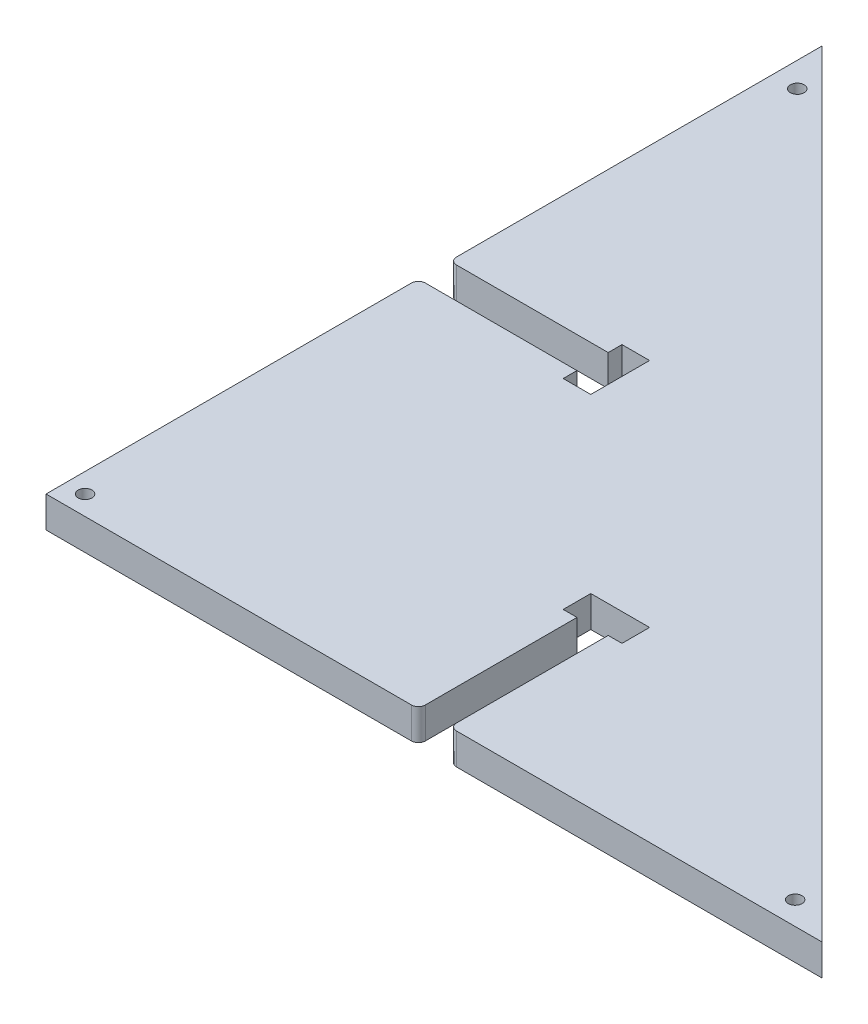
ISO-10303-21;
HEADER;
FILE_DESCRIPTION(('STEP AP214'),'2;1');
FILE_NAME('part.step','',(''),(''),'','','');
FILE_SCHEMA(('AUTOMOTIVE_DESIGN { 1 0 10303 214 1 1 1 1 }'));
ENDSEC;
DATA;
#1=APPLICATION_CONTEXT('core data for automotive mechanical design processes');
#2=APPLICATION_PROTOCOL_DEFINITION('international standard','automotive_design',2000,#1);
#3=PRODUCT_CONTEXT('',#1,'mechanical');
#4=PRODUCT('Part','Part','',(#3));
#5=PRODUCT_RELATED_PRODUCT_CATEGORY('part','',(#4));
#6=PRODUCT_DEFINITION_FORMATION('','',#4);
#7=PRODUCT_DEFINITION_CONTEXT('part definition',#1,'design');
#8=PRODUCT_DEFINITION('design','',#6,#7);
#9=PRODUCT_DEFINITION_SHAPE('','',#8);
#10=(LENGTH_UNIT() NAMED_UNIT(*) SI_UNIT(.MILLI.,.METRE.));
#11=(NAMED_UNIT(*) PLANE_ANGLE_UNIT() SI_UNIT($,.RADIAN.));
#12=(NAMED_UNIT(*) SI_UNIT($,.STERADIAN.) SOLID_ANGLE_UNIT());
#13=UNCERTAINTY_MEASURE_WITH_UNIT(LENGTH_MEASURE(1.E-05),#10,'distance_accuracy_value','');
#14=(GEOMETRIC_REPRESENTATION_CONTEXT(3) GLOBAL_UNCERTAINTY_ASSIGNED_CONTEXT((#13)) GLOBAL_UNIT_ASSIGNED_CONTEXT((#10,
#11,#12)) REPRESENTATION_CONTEXT('',''));
#15=CARTESIAN_POINT('',(0.,0.,0.));
#16=DIRECTION('',(0.,0.,1.));
#17=DIRECTION('',(1.,0.,0.));
#18=AXIS2_PLACEMENT_3D('',#15,#16,#17);
#19=CARTESIAN_POINT('',(176.552661596958,18.1,0.));
#20=DIRECTION('',(-1.,0.,0.));
#21=DIRECTION('',(0.,0.,1.));
#22=AXIS2_PLACEMENT_3D('',#19,#20,#21);
#23=PLANE('',#22);
#24=DIRECTION('',(0.,0.,-1.));
#25=VECTOR('',#24,1.);
#26=CARTESIAN_POINT('',(176.552661596958,0.,0.));
#27=LINE('',#26,#25);
#28=CARTESIAN_POINT('',(176.552661596958,0.,-58.5244296577947));
#29=VERTEX_POINT('',#28);
#30=CARTESIAN_POINT('',(176.552661596958,0.,-74.5244296577947));
#31=VERTEX_POINT('',#30);
#32=EDGE_CURVE('E258',#29,#31,#27,.T.);
#33=ORIENTED_EDGE('',*,*,#32,.T.);
#34=DIRECTION('',(0.,-1.,0.));
#35=VECTOR('',#34,1.);
#36=CARTESIAN_POINT('',(176.552661596958,18.1,-74.5244296577947));
#37=LINE('',#36,#35);
#38=CARTESIAN_POINT('',(176.552661596958,18.1,-74.5244296577947));
#39=VERTEX_POINT('',#38);
#40=EDGE_CURVE('E12',#39,#31,#37,.T.);
#41=ORIENTED_EDGE('',*,*,#40,.F.);
#42=DIRECTION('',(0.,0.,-1.));
#43=VECTOR('',#42,1.);
#44=CARTESIAN_POINT('',(176.552661596958,18.1,0.));
#45=LINE('',#44,#43);
#46=CARTESIAN_POINT('',(176.552661596958,18.1,-58.5244296577947));
#47=VERTEX_POINT('',#46);
#48=EDGE_CURVE('E329',#47,#39,#45,.T.);
#49=ORIENTED_EDGE('',*,*,#48,.F.);
#50=DIRECTION('',(0.,-1.,0.));
#51=VECTOR('',#50,1.);
#52=CARTESIAN_POINT('',(176.552661596958,18.1,-58.5244296577947));
#53=LINE('',#52,#51);
#54=EDGE_CURVE('E257',#47,#29,#53,.T.);
#55=ORIENTED_EDGE('',*,*,#54,.T.);
#56=EDGE_LOOP('',(#33,#41,#49,#55));
#57=FACE_BOUND('',#56,.T.);
#58=ADVANCED_FACE('F41',(#57),#23,.F.);
#59=CARTESIAN_POINT('',(0.,18.1,-74.5244296577947));
#60=DIRECTION('',(0.,0.,-1.));
#61=DIRECTION('',(-1.,0.,0.));
#62=AXIS2_PLACEMENT_3D('',#59,#60,#61);
#63=PLANE('',#62);
#64=DIRECTION('',(1.,0.,0.));
#65=VECTOR('',#64,1.);
#66=CARTESIAN_POINT('',(0.,0.,-74.5244296577947));
#67=LINE('',#66,#65);
#68=CARTESIAN_POINT('',(210.652661596958,0.,-74.5244296577947));
#69=VERTEX_POINT('',#68);
#70=EDGE_CURVE('E261',#31,#69,#67,.T.);
#71=ORIENTED_EDGE('',*,*,#70,.T.);
#72=DIRECTION('',(0.,-1.,0.));
#73=VECTOR('',#72,1.);
#74=CARTESIAN_POINT('',(210.652661596958,18.1,-74.5244296577947));
#75=LINE('',#74,#73);
#76=CARTESIAN_POINT('',(210.652661596958,18.1,-74.5244296577947));
#77=VERTEX_POINT('',#76);
#78=EDGE_CURVE('E49',#77,#69,#75,.T.);
#79=ORIENTED_EDGE('',*,*,#78,.F.);
#80=DIRECTION('',(1.,0.,0.));
#81=VECTOR('',#80,1.);
#82=CARTESIAN_POINT('',(0.,18.1,-74.5244296577947));
#83=LINE('',#82,#81);
#84=EDGE_CURVE('E146',#39,#77,#83,.T.);
#85=ORIENTED_EDGE('',*,*,#84,.F.);
#86=ORIENTED_EDGE('',*,*,#40,.T.);
#87=EDGE_LOOP('',(#71,#79,#85,#86));
#88=FACE_BOUND('',#87,.T.);
#89=ADVANCED_FACE('F508',(#88),#63,.F.);
#90=CARTESIAN_POINT('',(210.652661596958,18.1,3.65424117349241E-13));
#91=DIRECTION('',(1.,0.,0.));
#92=DIRECTION('',(0.,0.,-1.));
#93=AXIS2_PLACEMENT_3D('',#90,#91,#92);
#94=PLANE('',#93);
#95=DIRECTION('',(0.,0.,1.));
#96=VECTOR('',#95,1.);
#97=CARTESIAN_POINT('',(210.652661596958,0.,3.65424117349241E-13));
#98=LINE('',#97,#96);
#99=CARTESIAN_POINT('',(210.652661596958,0.,-58.5244296577947));
#100=VERTEX_POINT('',#99);
#101=EDGE_CURVE('E263',#69,#100,#98,.T.);
#102=ORIENTED_EDGE('',*,*,#101,.T.);
#103=DIRECTION('',(0.,-1.,0.));
#104=VECTOR('',#103,1.);
#105=CARTESIAN_POINT('',(210.652661596958,18.1,-58.5244296577947));
#106=LINE('',#105,#104);
#107=CARTESIAN_POINT('',(210.652661596958,18.1,-58.5244296577947));
#108=VERTEX_POINT('',#107);
#109=EDGE_CURVE('E380',#108,#100,#106,.T.);
#110=ORIENTED_EDGE('',*,*,#109,.F.);
#111=DIRECTION('',(0.,0.,1.));
#112=VECTOR('',#111,1.);
#113=CARTESIAN_POINT('',(210.652661596958,18.1,3.65424117349241E-13));
#114=LINE('',#113,#112);
#115=EDGE_CURVE('E388',#77,#108,#114,.T.);
#116=ORIENTED_EDGE('',*,*,#115,.F.);
#117=ORIENTED_EDGE('',*,*,#78,.T.);
#118=EDGE_LOOP('',(#102,#110,#116,#117));
#119=FACE_BOUND('',#118,.T.);
#120=ADVANCED_FACE('F386',(#119),#94,.F.);
#121=CARTESIAN_POINT('',(0.,18.1,-58.5244296577947));
#122=DIRECTION('',(0.,0.,1.));
#123=DIRECTION('',(1.,0.,0.));
#124=AXIS2_PLACEMENT_3D('',#121,#122,#123);
#125=PLANE('',#124);
#126=DIRECTION('',(-1.,0.,0.));
#127=VECTOR('',#126,1.);
#128=CARTESIAN_POINT('',(0.,0.,-58.5244296577947));
#129=LINE('',#128,#127);
#130=CARTESIAN_POINT('',(202.652661596958,0.,-58.5244296577947));
#131=VERTEX_POINT('',#130);
#132=EDGE_CURVE('E265',#100,#131,#129,.T.);
#133=ORIENTED_EDGE('',*,*,#132,.T.);
#134=DIRECTION('',(0.,-1.,0.));
#135=VECTOR('',#134,1.);
#136=CARTESIAN_POINT('',(202.652661596958,18.1,-58.5244296577947));
#137=LINE('',#136,#135);
#138=CARTESIAN_POINT('',(202.652661596958,18.1,-58.5244296577947));
#139=VERTEX_POINT('',#138);
#140=EDGE_CURVE('E377',#139,#131,#137,.T.);
#141=ORIENTED_EDGE('',*,*,#140,.F.);
#142=DIRECTION('',(-1.,0.,0.));
#143=VECTOR('',#142,1.);
#144=CARTESIAN_POINT('',(0.,18.1,-58.5244296577947));
#145=LINE('',#144,#143);
#146=EDGE_CURVE('E407',#108,#139,#145,.T.);
#147=ORIENTED_EDGE('',*,*,#146,.F.);
#148=ORIENTED_EDGE('',*,*,#109,.T.);
#149=EDGE_LOOP('',(#133,#141,#147,#148));
#150=FACE_BOUND('',#149,.T.);
#151=ADVANCED_FACE('F398',(#150),#125,.F.);
#152=CARTESIAN_POINT('',(202.652661596958,18.1,0.));
#153=DIRECTION('',(1.,0.,0.));
#154=DIRECTION('',(0.,0.,-1.));
#155=AXIS2_PLACEMENT_3D('',#152,#153,#154);
#156=PLANE('',#155);
#157=DIRECTION('',(0.,0.,1.));
#158=VECTOR('',#157,1.);
#159=CARTESIAN_POINT('',(202.652661596958,0.,0.));
#160=LINE('',#159,#158);
#161=CARTESIAN_POINT('',(202.652661596958,0.,29.4505703422052));
#162=VERTEX_POINT('',#161);
#163=EDGE_CURVE('E267',#131,#162,#160,.T.);
#164=ORIENTED_EDGE('',*,*,#163,.T.);
#165=DIRECTION('',(0.,-1.,0.));
#166=VECTOR('',#165,1.);
#167=CARTESIAN_POINT('',(202.652661596958,18.1,29.4505703422052));
#168=LINE('',#167,#166);
#169=CARTESIAN_POINT('',(202.652661596958,18.1,29.4505703422052));
#170=VERTEX_POINT('',#169);
#171=EDGE_CURVE('E374',#170,#162,#168,.T.);
#172=ORIENTED_EDGE('',*,*,#171,.F.);
#173=DIRECTION('',(0.,0.,1.));
#174=VECTOR('',#173,1.);
#175=CARTESIAN_POINT('',(202.652661596958,18.1,0.));
#176=LINE('',#175,#174);
#177=EDGE_CURVE('E404',#139,#170,#176,.T.);
#178=ORIENTED_EDGE('',*,*,#177,.F.);
#179=ORIENTED_EDGE('',*,*,#140,.T.);
#180=EDGE_LOOP('',(#164,#172,#178,#179));
#181=FACE_BOUND('',#180,.T.);
#182=ADVANCED_FACE('F402',(#181),#156,.F.);
#183=CARTESIAN_POINT('',(206.652661596958,18.1,29.4505703422052));
#184=DIRECTION('',(0.,-1.,0.));
#185=DIRECTION('',(0.,0.,-1.));
#186=AXIS2_PLACEMENT_3D('',#183,#184,#185);
#187=CYLINDRICAL_SURFACE('',#186,4.00000000000001);
#188=CARTESIAN_POINT('',(206.652661596958,0.,29.4505703422052));
#189=DIRECTION('',(0.,1.,0.));
#190=DIRECTION('',(0.,0.,1.));
#191=AXIS2_PLACEMENT_3D('',#188,#189,#190);
#192=CIRCLE('',#191,4.00000000000001);
#193=CARTESIAN_POINT('',(206.652661596958,0.,33.4505703422053));
#194=VERTEX_POINT('',#193);
#195=EDGE_CURVE('E269',#162,#194,#192,.T.);
#196=ORIENTED_EDGE('',*,*,#195,.T.);
#197=DIRECTION('',(0.,-1.,0.));
#198=VECTOR('',#197,1.);
#199=CARTESIAN_POINT('',(206.652661596958,18.1,33.4505703422053));
#200=LINE('',#199,#198);
#201=CARTESIAN_POINT('',(206.652661596958,18.1,33.4505703422053));
#202=VERTEX_POINT('',#201);
#203=EDGE_CURVE('E371',#202,#194,#200,.T.);
#204=ORIENTED_EDGE('',*,*,#203,.F.);
#205=CARTESIAN_POINT('',(206.652661596958,18.1,29.4505703422052));
#206=DIRECTION('',(0.,1.,0.));
#207=DIRECTION('',(0.,0.,1.));
#208=AXIS2_PLACEMENT_3D('',#205,#206,#207);
#209=CIRCLE('',#208,4.00000000000001);
#210=EDGE_CURVE('E406',#170,#202,#209,.T.);
#211=ORIENTED_EDGE('',*,*,#210,.F.);
#212=ORIENTED_EDGE('',*,*,#171,.T.);
#213=EDGE_LOOP('',(#196,#204,#211,#212));
#214=FACE_BOUND('',#213,.T.);
#215=ADVANCED_FACE('F721',(#214),#187,.T.);
#216=CARTESIAN_POINT('',(0.,18.1,33.4505703422052));
#217=DIRECTION('',(0.,0.,-1.));
#218=DIRECTION('',(-1.,0.,0.));
#219=AXIS2_PLACEMENT_3D('',#216,#217,#218);
#220=PLANE('',#219);
#221=DIRECTION('',(1.,0.,0.));
#222=VECTOR('',#221,1.);
#223=CARTESIAN_POINT('',(0.,0.,33.4505703422052));
#224=LINE('',#223,#222);
#225=CARTESIAN_POINT('',(418.602661596958,0.,33.4505703422052));
#226=VERTEX_POINT('',#225);
#227=EDGE_CURVE('E271',#194,#226,#224,.T.);
#228=ORIENTED_EDGE('',*,*,#227,.T.);
#229=DIRECTION('',(0.,-1.,0.));
#230=VECTOR('',#229,1.);
#231=CARTESIAN_POINT('',(418.602661596958,18.1,33.4505703422052));
#232=LINE('',#231,#230);
#233=CARTESIAN_POINT('',(418.602661596958,18.1,33.4505703422052));
#234=VERTEX_POINT('',#233);
#235=EDGE_CURVE('E369',#234,#226,#232,.T.);
#236=ORIENTED_EDGE('',*,*,#235,.F.);
#237=DIRECTION('',(1.,0.,0.));
#238=VECTOR('',#237,1.);
#239=CARTESIAN_POINT('',(0.,18.1,33.4505703422052));
#240=LINE('',#239,#238);
#241=EDGE_CURVE('E409',#202,#234,#240,.T.);
#242=ORIENTED_EDGE('',*,*,#241,.F.);
#243=ORIENTED_EDGE('',*,*,#203,.T.);
#244=EDGE_LOOP('',(#228,#236,#242,#243));
#245=FACE_BOUND('',#244,.T.);
#246=ADVANCED_FACE('F558',(#245),#220,.F.);
#247=CARTESIAN_POINT('',(192.576045627376,18.1,-192.576045627376));
#248=DIRECTION('',(0.707106781186547,0.,-0.707106781186548));
#249=DIRECTION('',(-0.707106781186548,0.,-0.707106781186547));
#250=AXIS2_PLACEMENT_3D('',#247,#248,#249);
#251=PLANE('',#250);
#252=DIRECTION('',(0.707106781186548,0.,0.707106781186547));
#253=VECTOR('',#252,1.);
#254=CARTESIAN_POINT('',(192.576045627376,0.,-192.576045627376));
#255=LINE('',#254,#253);
#256=CARTESIAN_POINT('',(-31.3973384030419,0.,-416.549429657795));
#257=VERTEX_POINT('',#256);
#258=EDGE_CURVE('E274',#257,#226,#255,.T.);
#259=ORIENTED_EDGE('',*,*,#258,.F.);
#260=DIRECTION('',(0.,-1.,0.));
#261=VECTOR('',#260,1.);
#262=CARTESIAN_POINT('',(-31.3973384030419,18.1,-416.549429657795));
#263=LINE('',#262,#261);
#264=CARTESIAN_POINT('',(-31.3973384030419,18.1,-416.549429657795));
#265=VERTEX_POINT('',#264);
#266=EDGE_CURVE('E367',#265,#257,#263,.T.);
#267=ORIENTED_EDGE('',*,*,#266,.F.);
#268=DIRECTION('',(0.707106781186548,0.,0.707106781186547));
#269=VECTOR('',#268,1.);
#270=CARTESIAN_POINT('',(192.576045627376,18.1,-192.576045627376));
#271=LINE('',#270,#269);
#272=EDGE_CURVE('E426',#265,#234,#271,.T.);
#273=ORIENTED_EDGE('',*,*,#272,.T.);
#274=ORIENTED_EDGE('',*,*,#235,.T.);
#275=EDGE_LOOP('',(#259,#267,#273,#274));
#276=FACE_BOUND('',#275,.T.);
#277=ADVANCED_FACE('F554',(#276),#251,.T.);
#278=CARTESIAN_POINT('',(-31.3973384030418,18.1,0.));
#279=DIRECTION('',(-1.,0.,0.));
#280=DIRECTION('',(0.,0.,1.));
#281=AXIS2_PLACEMENT_3D('',#278,#279,#280);
#282=PLANE('',#281);
#283=DIRECTION('',(0.,0.,-1.));
#284=VECTOR('',#283,1.);
#285=CARTESIAN_POINT('',(-31.3973384030418,0.,0.));
#286=LINE('',#285,#284);
#287=CARTESIAN_POINT('',(-31.3973384030419,0.,-204.599429657795));
#288=VERTEX_POINT('',#287);
#289=EDGE_CURVE('E278',#288,#257,#286,.T.);
#290=ORIENTED_EDGE('',*,*,#289,.F.);
#291=DIRECTION('',(0.,-1.,0.));
#292=VECTOR('',#291,1.);
#293=CARTESIAN_POINT('',(-31.3973384030419,18.1,-204.599429657795));
#294=LINE('',#293,#292);
#295=CARTESIAN_POINT('',(-31.3973384030419,18.1,-204.599429657795));
#296=VERTEX_POINT('',#295);
#297=EDGE_CURVE('E364',#296,#288,#294,.T.);
#298=ORIENTED_EDGE('',*,*,#297,.F.);
#299=DIRECTION('',(0.,0.,-1.));
#300=VECTOR('',#299,1.);
#301=CARTESIAN_POINT('',(-31.3973384030418,18.1,0.));
#302=LINE('',#301,#300);
#303=EDGE_CURVE('E431',#296,#265,#302,.T.);
#304=ORIENTED_EDGE('',*,*,#303,.T.);
#305=ORIENTED_EDGE('',*,*,#266,.T.);
#306=EDGE_LOOP('',(#290,#298,#304,#305));
#307=FACE_BOUND('',#306,.T.);
#308=ADVANCED_FACE('F557',(#307),#282,.T.);
#309=CARTESIAN_POINT('',(-27.3973384030419,18.1,-204.599429657795));
#310=DIRECTION('',(0.,-1.,0.));
#311=DIRECTION('',(0.,0.,-1.));
#312=AXIS2_PLACEMENT_3D('',#309,#310,#311);
#313=CYLINDRICAL_SURFACE('',#312,4.00000000000001);
#314=CARTESIAN_POINT('',(-27.3973384030419,0.,-204.599429657795));
#315=DIRECTION('',(0.,1.,0.));
#316=DIRECTION('',(0.,0.,1.));
#317=AXIS2_PLACEMENT_3D('',#314,#315,#316);
#318=CIRCLE('',#317,4.00000000000001);
#319=CARTESIAN_POINT('',(-27.3973384030419,0.,-200.599429657795));
#320=VERTEX_POINT('',#319);
#321=EDGE_CURVE('E282',#288,#320,#318,.T.);
#322=ORIENTED_EDGE('',*,*,#321,.T.);
#323=DIRECTION('',(0.,-1.,0.));
#324=VECTOR('',#323,1.);
#325=CARTESIAN_POINT('',(-27.3973384030419,18.1,-200.599429657795));
#326=LINE('',#325,#324);
#327=CARTESIAN_POINT('',(-27.3973384030419,18.1,-200.599429657795));
#328=VERTEX_POINT('',#327);
#329=EDGE_CURVE('E361',#328,#320,#326,.T.);
#330=ORIENTED_EDGE('',*,*,#329,.F.);
#331=CARTESIAN_POINT('',(-27.3973384030419,18.1,-204.599429657795));
#332=DIRECTION('',(0.,1.,0.));
#333=DIRECTION('',(0.,0.,1.));
#334=AXIS2_PLACEMENT_3D('',#331,#332,#333);
#335=CIRCLE('',#334,4.00000000000001);
#336=EDGE_CURVE('E436',#296,#328,#335,.T.);
#337=ORIENTED_EDGE('',*,*,#336,.F.);
#338=ORIENTED_EDGE('',*,*,#297,.T.);
#339=EDGE_LOOP('',(#322,#330,#337,#338));
#340=FACE_BOUND('',#339,.T.);
#341=ADVANCED_FACE('F572',(#340),#313,.T.);
#342=CARTESIAN_POINT('',(0.,18.1,-200.599429657795));
#343=DIRECTION('',(0.,0.,1.));
#344=DIRECTION('',(1.,0.,0.));
#345=AXIS2_PLACEMENT_3D('',#342,#343,#344);
#346=PLANE('',#345);
#347=DIRECTION('',(-1.,0.,0.));
#348=VECTOR('',#347,1.);
#349=CARTESIAN_POINT('',(0.,0.,-200.599429657795));
#350=LINE('',#349,#348);
#351=CARTESIAN_POINT('',(60.5776615969581,0.,-200.599429657795));
#352=VERTEX_POINT('',#351);
#353=EDGE_CURVE('E286',#352,#320,#350,.T.);
#354=ORIENTED_EDGE('',*,*,#353,.F.);
#355=DIRECTION('',(0.,-1.,0.));
#356=VECTOR('',#355,1.);
#357=CARTESIAN_POINT('',(60.5776615969581,18.1,-200.599429657795));
#358=LINE('',#357,#356);
#359=CARTESIAN_POINT('',(60.5776615969581,18.1,-200.599429657795));
#360=VERTEX_POINT('',#359);
#361=EDGE_CURVE('E358',#360,#352,#358,.T.);
#362=ORIENTED_EDGE('',*,*,#361,.F.);
#363=DIRECTION('',(-1.,0.,0.));
#364=VECTOR('',#363,1.);
#365=CARTESIAN_POINT('',(0.,18.1,-200.599429657795));
#366=LINE('',#365,#364);
#367=EDGE_CURVE('E444',#360,#328,#366,.T.);
#368=ORIENTED_EDGE('',*,*,#367,.T.);
#369=ORIENTED_EDGE('',*,*,#329,.T.);
#370=EDGE_LOOP('',(#354,#362,#368,#369));
#371=FACE_BOUND('',#370,.T.);
#372=ADVANCED_FACE('F580',(#371),#346,.T.);
#373=CARTESIAN_POINT('',(60.5776615969579,18.1,0.));
#374=DIRECTION('',(-1.,0.,0.));
#375=DIRECTION('',(0.,0.,1.));
#376=AXIS2_PLACEMENT_3D('',#373,#374,#375);
#377=PLANE('',#376);
#378=DIRECTION('',(0.,0.,-1.));
#379=VECTOR('',#378,1.);
#380=CARTESIAN_POINT('',(60.5776615969579,0.,0.));
#381=LINE('',#380,#379);
#382=CARTESIAN_POINT('',(60.5776615969581,0.,-208.599429657795));
#383=VERTEX_POINT('',#382);
#384=EDGE_CURVE('E290',#352,#383,#381,.T.);
#385=ORIENTED_EDGE('',*,*,#384,.T.);
#386=DIRECTION('',(0.,-1.,0.));
#387=VECTOR('',#386,1.);
#388=CARTESIAN_POINT('',(60.5776615969581,18.1,-208.599429657795));
#389=LINE('',#388,#387);
#390=CARTESIAN_POINT('',(60.5776615969581,18.1,-208.599429657795));
#391=VERTEX_POINT('',#390);
#392=EDGE_CURVE('E354',#391,#383,#389,.T.);
#393=ORIENTED_EDGE('',*,*,#392,.F.);
#394=DIRECTION('',(0.,0.,-1.));
#395=VECTOR('',#394,1.);
#396=CARTESIAN_POINT('',(60.5776615969579,18.1,0.));
#397=LINE('',#396,#395);
#398=EDGE_CURVE('E448',#360,#391,#397,.T.);
#399=ORIENTED_EDGE('',*,*,#398,.F.);
#400=ORIENTED_EDGE('',*,*,#361,.T.);
#401=EDGE_LOOP('',(#385,#393,#399,#400));
#402=FACE_BOUND('',#401,.T.);
#403=ADVANCED_FACE('F588',(#402),#377,.F.);
#404=CARTESIAN_POINT('',(0.,18.1,-208.599429657795));
#405=DIRECTION('',(0.,0.,-1.));
#406=DIRECTION('',(-1.,0.,0.));
#407=AXIS2_PLACEMENT_3D('',#404,#405,#406);
#408=PLANE('',#407);
#409=DIRECTION('',(1.,0.,0.));
#410=VECTOR('',#409,1.);
#411=CARTESIAN_POINT('',(0.,0.,-208.599429657795));
#412=LINE('',#411,#410);
#413=CARTESIAN_POINT('',(76.5776615969581,0.,-208.599429657795));
#414=VERTEX_POINT('',#413);
#415=EDGE_CURVE('E293',#383,#414,#412,.T.);
#416=ORIENTED_EDGE('',*,*,#415,.T.);
#417=DIRECTION('',(0.,-1.,0.));
#418=VECTOR('',#417,1.);
#419=CARTESIAN_POINT('',(76.5776615969581,18.1,-208.599429657795));
#420=LINE('',#419,#418);
#421=CARTESIAN_POINT('',(76.5776615969581,18.1,-208.599429657795));
#422=VERTEX_POINT('',#421);
#423=EDGE_CURVE('E351',#422,#414,#420,.T.);
#424=ORIENTED_EDGE('',*,*,#423,.F.);
#425=DIRECTION('',(1.,0.,0.));
#426=VECTOR('',#425,1.);
#427=CARTESIAN_POINT('',(0.,18.1,-208.599429657795));
#428=LINE('',#427,#426);
#429=EDGE_CURVE('E452',#391,#422,#428,.T.);
#430=ORIENTED_EDGE('',*,*,#429,.F.);
#431=ORIENTED_EDGE('',*,*,#392,.T.);
#432=EDGE_LOOP('',(#416,#424,#430,#431));
#433=FACE_BOUND('',#432,.T.);
#434=ADVANCED_FACE('F596',(#433),#408,.F.);
#435=CARTESIAN_POINT('',(76.5776615969582,18.1,0.));
#436=DIRECTION('',(1.,0.,0.));
#437=DIRECTION('',(0.,0.,-1.));
#438=AXIS2_PLACEMENT_3D('',#435,#436,#437);
#439=PLANE('',#438);
#440=DIRECTION('',(0.,0.,1.));
#441=VECTOR('',#440,1.);
#442=CARTESIAN_POINT('',(76.5776615969582,0.,0.));
#443=LINE('',#442,#441);
#444=CARTESIAN_POINT('',(76.5776615969581,0.,-174.499429657795));
#445=VERTEX_POINT('',#444);
#446=EDGE_CURVE('E296',#414,#445,#443,.T.);
#447=ORIENTED_EDGE('',*,*,#446,.T.);
#448=DIRECTION('',(0.,-1.,0.));
#449=VECTOR('',#448,1.);
#450=CARTESIAN_POINT('',(76.5776615969581,18.1,-174.499429657795));
#451=LINE('',#450,#449);
#452=CARTESIAN_POINT('',(76.5776615969581,18.1,-174.499429657795));
#453=VERTEX_POINT('',#452);
#454=EDGE_CURVE('E348',#453,#445,#451,.T.);
#455=ORIENTED_EDGE('',*,*,#454,.F.);
#456=DIRECTION('',(0.,0.,1.));
#457=VECTOR('',#456,1.);
#458=CARTESIAN_POINT('',(76.5776615969582,18.1,0.));
#459=LINE('',#458,#457);
#460=EDGE_CURVE('E456',#422,#453,#459,.T.);
#461=ORIENTED_EDGE('',*,*,#460,.F.);
#462=ORIENTED_EDGE('',*,*,#423,.T.);
#463=EDGE_LOOP('',(#447,#455,#461,#462));
#464=FACE_BOUND('',#463,.T.);
#465=ADVANCED_FACE('F604',(#464),#439,.F.);
#466=CARTESIAN_POINT('',(0.,18.1,-174.499429657795));
#467=DIRECTION('',(0.,0.,1.));
#468=DIRECTION('',(1.,0.,0.));
#469=AXIS2_PLACEMENT_3D('',#466,#467,#468);
#470=PLANE('',#469);
#471=DIRECTION('',(-1.,0.,0.));
#472=VECTOR('',#471,1.);
#473=CARTESIAN_POINT('',(0.,0.,-174.499429657795));
#474=LINE('',#473,#472);
#475=CARTESIAN_POINT('',(60.5776615969581,0.,-174.499429657795));
#476=VERTEX_POINT('',#475);
#477=EDGE_CURVE('E298',#445,#476,#474,.T.);
#478=ORIENTED_EDGE('',*,*,#477,.T.);
#479=DIRECTION('',(0.,-1.,0.));
#480=VECTOR('',#479,1.);
#481=CARTESIAN_POINT('',(60.5776615969581,18.1,-174.499429657795));
#482=LINE('',#481,#480);
#483=CARTESIAN_POINT('',(60.5776615969581,18.1,-174.499429657795));
#484=VERTEX_POINT('',#483);
#485=EDGE_CURVE('E345',#484,#476,#482,.T.);
#486=ORIENTED_EDGE('',*,*,#485,.F.);
#487=DIRECTION('',(-1.,0.,0.));
#488=VECTOR('',#487,1.);
#489=CARTESIAN_POINT('',(0.,18.1,-174.499429657795));
#490=LINE('',#489,#488);
#491=EDGE_CURVE('E464',#453,#484,#490,.T.);
#492=ORIENTED_EDGE('',*,*,#491,.F.);
#493=ORIENTED_EDGE('',*,*,#454,.T.);
#494=EDGE_LOOP('',(#478,#486,#492,#493));
#495=FACE_BOUND('',#494,.T.);
#496=ADVANCED_FACE('F612',(#495),#470,.F.);
#497=CARTESIAN_POINT('',(60.5776615969579,18.1,0.));
#498=DIRECTION('',(-1.,0.,0.));
#499=DIRECTION('',(0.,0.,1.));
#500=AXIS2_PLACEMENT_3D('',#497,#498,#499);
#501=PLANE('',#500);
#502=DIRECTION('',(0.,0.,-1.));
#503=VECTOR('',#502,1.);
#504=CARTESIAN_POINT('',(60.5776615969579,0.,0.));
#505=LINE('',#504,#503);
#506=CARTESIAN_POINT('',(60.5776615969581,0.,-182.499429657795));
#507=VERTEX_POINT('',#506);
#508=EDGE_CURVE('E300',#476,#507,#505,.T.);
#509=ORIENTED_EDGE('',*,*,#508,.T.);
#510=DIRECTION('',(0.,-1.,0.));
#511=VECTOR('',#510,1.);
#512=CARTESIAN_POINT('',(60.5776615969581,18.1,-182.499429657795));
#513=LINE('',#512,#511);
#514=CARTESIAN_POINT('',(60.5776615969581,18.1,-182.499429657795));
#515=VERTEX_POINT('',#514);
#516=EDGE_CURVE('E342',#515,#507,#513,.T.);
#517=ORIENTED_EDGE('',*,*,#516,.F.);
#518=DIRECTION('',(0.,0.,-1.));
#519=VECTOR('',#518,1.);
#520=CARTESIAN_POINT('',(60.5776615969579,18.1,0.));
#521=LINE('',#520,#519);
#522=EDGE_CURVE('E466',#484,#515,#521,.T.);
#523=ORIENTED_EDGE('',*,*,#522,.F.);
#524=ORIENTED_EDGE('',*,*,#485,.T.);
#525=EDGE_LOOP('',(#509,#517,#523,#524));
#526=FACE_BOUND('',#525,.T.);
#527=ADVANCED_FACE('F620',(#526),#501,.F.);
#528=CARTESIAN_POINT('',(0.,18.1,-182.499429657795));
#529=DIRECTION('',(0.,0.,1.));
#530=DIRECTION('',(1.,0.,0.));
#531=AXIS2_PLACEMENT_3D('',#528,#529,#530);
#532=PLANE('',#531);
#533=DIRECTION('',(-1.,0.,0.));
#534=VECTOR('',#533,1.);
#535=CARTESIAN_POINT('',(0.,0.,-182.499429657795));
#536=LINE('',#535,#534);
#537=CARTESIAN_POINT('',(-27.3973384030419,0.,-182.499429657795));
#538=VERTEX_POINT('',#537);
#539=EDGE_CURVE('E302',#507,#538,#536,.T.);
#540=ORIENTED_EDGE('',*,*,#539,.T.);
#541=DIRECTION('',(0.,-1.,0.));
#542=VECTOR('',#541,1.);
#543=CARTESIAN_POINT('',(-27.3973384030419,18.1,-182.499429657795));
#544=LINE('',#543,#542);
#545=CARTESIAN_POINT('',(-27.3973384030419,18.1,-182.499429657795));
#546=VERTEX_POINT('',#545);
#547=EDGE_CURVE('E338',#546,#538,#544,.T.);
#548=ORIENTED_EDGE('',*,*,#547,.F.);
#549=DIRECTION('',(-1.,0.,0.));
#550=VECTOR('',#549,1.);
#551=CARTESIAN_POINT('',(0.,18.1,-182.499429657795));
#552=LINE('',#551,#550);
#553=EDGE_CURVE('E469',#515,#546,#552,.T.);
#554=ORIENTED_EDGE('',*,*,#553,.F.);
#555=ORIENTED_EDGE('',*,*,#516,.T.);
#556=EDGE_LOOP('',(#540,#548,#554,#555));
#557=FACE_BOUND('',#556,.T.);
#558=ADVANCED_FACE('F628',(#557),#532,.F.);
#559=CARTESIAN_POINT('',(-27.3973384030419,18.1,-178.499429657795));
#560=DIRECTION('',(0.,-1.,0.));
#561=DIRECTION('',(0.,0.,-1.));
#562=AXIS2_PLACEMENT_3D('',#559,#560,#561);
#563=CYLINDRICAL_SURFACE('',#562,4.);
#564=CARTESIAN_POINT('',(-27.3973384030419,0.,-178.499429657795));
#565=DIRECTION('',(0.,1.,0.));
#566=DIRECTION('',(0.,0.,1.));
#567=AXIS2_PLACEMENT_3D('',#564,#565,#566);
#568=CIRCLE('',#567,4.);
#569=CARTESIAN_POINT('',(-31.3973384030419,0.,-178.499429657795));
#570=VERTEX_POINT('',#569);
#571=EDGE_CURVE('E305',#538,#570,#568,.T.);
#572=ORIENTED_EDGE('',*,*,#571,.T.);
#573=DIRECTION('',(0.,-1.,0.));
#574=VECTOR('',#573,1.);
#575=CARTESIAN_POINT('',(-31.3973384030419,18.1,-178.499429657795));
#576=LINE('',#575,#574);
#577=CARTESIAN_POINT('',(-31.3973384030419,18.1,-178.499429657795));
#578=VERTEX_POINT('',#577);
#579=EDGE_CURVE('E335',#578,#570,#576,.T.);
#580=ORIENTED_EDGE('',*,*,#579,.F.);
#581=CARTESIAN_POINT('',(-27.3973384030419,18.1,-178.499429657795));
#582=DIRECTION('',(0.,1.,0.));
#583=DIRECTION('',(0.,0.,1.));
#584=AXIS2_PLACEMENT_3D('',#581,#582,#583);
#585=CIRCLE('',#584,4.);
#586=EDGE_CURVE('E473',#546,#578,#585,.T.);
#587=ORIENTED_EDGE('',*,*,#586,.F.);
#588=ORIENTED_EDGE('',*,*,#547,.T.);
#589=EDGE_LOOP('',(#572,#580,#587,#588));
#590=FACE_BOUND('',#589,.T.);
#591=ADVANCED_FACE('F491',(#590),#563,.T.);
#592=CARTESIAN_POINT('',(-31.3973384030418,18.1,0.));
#593=DIRECTION('',(-1.,0.,0.));
#594=DIRECTION('',(0.,0.,1.));
#595=AXIS2_PLACEMENT_3D('',#592,#593,#594);
#596=PLANE('',#595);
#597=DIRECTION('',(0.,0.,-1.));
#598=VECTOR('',#597,1.);
#599=CARTESIAN_POINT('',(-31.3973384030418,0.,0.));
#600=LINE('',#599,#598);
#601=CARTESIAN_POINT('',(-31.3973384030418,0.,33.4505703422053));
#602=VERTEX_POINT('',#601);
#603=EDGE_CURVE('E309',#602,#570,#600,.T.);
#604=ORIENTED_EDGE('',*,*,#603,.F.);
#605=DIRECTION('',(0.,-1.,0.));
#606=VECTOR('',#605,1.);
#607=CARTESIAN_POINT('',(-31.3973384030418,18.1,33.4505703422053));
#608=LINE('',#607,#606);
#609=CARTESIAN_POINT('',(-31.3973384030418,18.1,33.4505703422053));
#610=VERTEX_POINT('',#609);
#611=EDGE_CURVE('E333',#610,#602,#608,.T.);
#612=ORIENTED_EDGE('',*,*,#611,.F.);
#613=DIRECTION('',(0.,0.,-1.));
#614=VECTOR('',#613,1.);
#615=CARTESIAN_POINT('',(-31.3973384030418,18.1,0.));
#616=LINE('',#615,#614);
#617=EDGE_CURVE('E478',#610,#578,#616,.T.);
#618=ORIENTED_EDGE('',*,*,#617,.T.);
#619=ORIENTED_EDGE('',*,*,#579,.T.);
#620=EDGE_LOOP('',(#604,#612,#618,#619));
#621=FACE_BOUND('',#620,.T.);
#622=ADVANCED_FACE('F494',(#621),#596,.T.);
#623=CARTESIAN_POINT('',(0.,18.1,33.4505703422053));
#624=DIRECTION('',(0.,0.,-1.));
#625=DIRECTION('',(-1.,0.,0.));
#626=AXIS2_PLACEMENT_3D('',#623,#624,#625);
#627=PLANE('',#626);
#628=DIRECTION('',(1.,0.,0.));
#629=VECTOR('',#628,1.);
#630=CARTESIAN_POINT('',(0.,0.,33.4505703422053));
#631=LINE('',#630,#629);
#632=CARTESIAN_POINT('',(180.552661596958,0.,33.4505703422052));
#633=VERTEX_POINT('',#632);
#634=EDGE_CURVE('E313',#602,#633,#631,.T.);
#635=ORIENTED_EDGE('',*,*,#634,.T.);
#636=DIRECTION('',(0.,-1.,0.));
#637=VECTOR('',#636,1.);
#638=CARTESIAN_POINT('',(180.552661596958,18.1,33.4505703422052));
#639=LINE('',#638,#637);
#640=CARTESIAN_POINT('',(180.552661596958,18.1,33.4505703422052));
#641=VERTEX_POINT('',#640);
#642=EDGE_CURVE('E231',#641,#633,#639,.T.);
#643=ORIENTED_EDGE('',*,*,#642,.F.);
#644=DIRECTION('',(1.,0.,0.));
#645=VECTOR('',#644,1.);
#646=CARTESIAN_POINT('',(0.,18.1,33.4505703422053));
#647=LINE('',#646,#645);
#648=EDGE_CURVE('E218',#610,#641,#647,.T.);
#649=ORIENTED_EDGE('',*,*,#648,.F.);
#650=ORIENTED_EDGE('',*,*,#611,.T.);
#651=EDGE_LOOP('',(#635,#643,#649,#650));
#652=FACE_BOUND('',#651,.T.);
#653=ADVANCED_FACE('F498',(#652),#627,.F.);
#654=CARTESIAN_POINT('',(180.552661596958,18.1,29.4505703422053));
#655=DIRECTION('',(0.,-1.,0.));
#656=DIRECTION('',(0.,0.,-1.));
#657=AXIS2_PLACEMENT_3D('',#654,#655,#656);
#658=CYLINDRICAL_SURFACE('',#657,4.00000000000001);
#659=CARTESIAN_POINT('',(180.552661596958,0.,29.4505703422053));
#660=DIRECTION('',(0.,1.,0.));
#661=DIRECTION('',(0.,0.,1.));
#662=AXIS2_PLACEMENT_3D('',#659,#660,#661);
#663=CIRCLE('',#662,4.00000000000001);
#664=CARTESIAN_POINT('',(184.552661596958,0.,29.4505703422052));
#665=VERTEX_POINT('',#664);
#666=EDGE_CURVE('E227',#633,#665,#663,.T.);
#667=ORIENTED_EDGE('',*,*,#666,.T.);
#668=DIRECTION('',(0.,-1.,0.));
#669=VECTOR('',#668,1.);
#670=CARTESIAN_POINT('',(184.552661596958,18.1,29.4505703422052));
#671=LINE('',#670,#669);
#672=CARTESIAN_POINT('',(184.552661596958,18.1,29.4505703422052));
#673=VERTEX_POINT('',#672);
#674=EDGE_CURVE('E224',#673,#665,#671,.T.);
#675=ORIENTED_EDGE('',*,*,#674,.F.);
#676=CARTESIAN_POINT('',(180.552661596958,18.1,29.4505703422053));
#677=DIRECTION('',(0.,1.,0.));
#678=DIRECTION('',(0.,0.,1.));
#679=AXIS2_PLACEMENT_3D('',#676,#677,#678);
#680=CIRCLE('',#679,4.00000000000001);
#681=EDGE_CURVE('E210',#641,#673,#680,.T.);
#682=ORIENTED_EDGE('',*,*,#681,.F.);
#683=ORIENTED_EDGE('',*,*,#642,.T.);
#684=EDGE_LOOP('',(#667,#675,#682,#683));
#685=FACE_BOUND('',#684,.T.);
#686=ADVANCED_FACE('F225',(#685),#658,.T.);
#687=CARTESIAN_POINT('',(184.552661596958,18.1,-1.746757153971E-13));
#688=DIRECTION('',(1.,0.,0.));
#689=DIRECTION('',(0.,0.,-1.));
#690=AXIS2_PLACEMENT_3D('',#687,#688,#689);
#691=PLANE('',#690);
#692=DIRECTION('',(0.,0.,1.));
#693=VECTOR('',#692,1.);
#694=CARTESIAN_POINT('',(184.552661596958,0.,-1.746757153971E-13));
#695=LINE('',#694,#693);
#696=CARTESIAN_POINT('',(184.552661596958,0.,-58.5244296577947));
#697=VERTEX_POINT('',#696);
#698=EDGE_CURVE('E316',#697,#665,#695,.T.);
#699=ORIENTED_EDGE('',*,*,#698,.F.);
#700=DIRECTION('',(0.,-1.,0.));
#701=VECTOR('',#700,1.);
#702=CARTESIAN_POINT('',(184.552661596958,18.1,-58.5244296577947));
#703=LINE('',#702,#701);
#704=CARTESIAN_POINT('',(184.552661596958,18.1,-58.5244296577947));
#705=VERTEX_POINT('',#704);
#706=EDGE_CURVE('E135',#705,#697,#703,.T.);
#707=ORIENTED_EDGE('',*,*,#706,.F.);
#708=DIRECTION('',(0.,0.,1.));
#709=VECTOR('',#708,1.);
#710=CARTESIAN_POINT('',(184.552661596958,18.1,-1.746757153971E-13));
#711=LINE('',#710,#709);
#712=EDGE_CURVE('E215',#705,#673,#711,.T.);
#713=ORIENTED_EDGE('',*,*,#712,.T.);
#714=ORIENTED_EDGE('',*,*,#674,.T.);
#715=EDGE_LOOP('',(#699,#707,#713,#714));
#716=FACE_BOUND('',#715,.T.);
#717=ADVANCED_FACE('F233',(#716),#691,.T.);
#718=CARTESIAN_POINT('',(-17.0865033470433,18.1,-387.927759545797));
#719=DIRECTION('',(0.,-1.,0.));
#720=DIRECTION('',(0.,0.,-1.));
#721=AXIS2_PLACEMENT_3D('',#718,#719,#720);
#722=CYLINDRICAL_SURFACE('',#721,4.);
#723=CARTESIAN_POINT('',(-17.0865033470433,18.1,-387.927759545797));
#724=DIRECTION('',(0.,1.,0.));
#725=DIRECTION('',(0.,0.,1.));
#726=AXIS2_PLACEMENT_3D('',#723,#724,#725);
#727=CIRCLE('',#726,4.);
#728=CARTESIAN_POINT('',(-17.0865033470433,18.1,-383.927759545797));
#729=VERTEX_POINT('',#728);
#730=EDGE_CURVE('E250',#729,#729,#727,.T.);
#731=ORIENTED_EDGE('',*,*,#730,.T.);
#732=EDGE_LOOP('',(#731));
#733=FACE_BOUND('',#732,.T.);
#734=CARTESIAN_POINT('',(-17.0865033470433,0.,-387.927759545797));
#735=DIRECTION('',(0.,1.,0.));
#736=DIRECTION('',(0.,0.,1.));
#737=AXIS2_PLACEMENT_3D('',#734,#735,#736);
#738=CIRCLE('',#737,4.);
#739=CARTESIAN_POINT('',(-17.0865033470433,0.,-383.927759545797));
#740=VERTEX_POINT('',#739);
#741=EDGE_CURVE('E322',#740,#740,#738,.T.);
#742=ORIENTED_EDGE('',*,*,#741,.F.);
#743=EDGE_LOOP('',(#742));
#744=FACE_BOUND('',#743,.T.);
#745=ADVANCED_FACE('F526',(#733,#744),#722,.F.);
#746=CARTESIAN_POINT('',(389.574293694473,18.1,19.9838017276503));
#747=DIRECTION('',(0.,-1.,0.));
#748=DIRECTION('',(0.,0.,-1.));
#749=AXIS2_PLACEMENT_3D('',#746,#747,#748);
#750=CYLINDRICAL_SURFACE('',#749,3.99999999999999);
#751=CARTESIAN_POINT('',(389.574293694473,18.1,19.9838017276503));
#752=DIRECTION('',(0.,1.,0.));
#753=DIRECTION('',(0.,0.,1.));
#754=AXIS2_PLACEMENT_3D('',#751,#752,#753);
#755=CIRCLE('',#754,3.99999999999999);
#756=CARTESIAN_POINT('',(389.574293694473,18.1,23.9838017276503));
#757=VERTEX_POINT('',#756);
#758=EDGE_CURVE('E235',#757,#757,#755,.T.);
#759=ORIENTED_EDGE('',*,*,#758,.T.);
#760=EDGE_LOOP('',(#759));
#761=FACE_BOUND('',#760,.T.);
#762=CARTESIAN_POINT('',(389.574293694473,0.,19.9838017276503));
#763=DIRECTION('',(0.,1.,0.));
#764=DIRECTION('',(0.,0.,1.));
#765=AXIS2_PLACEMENT_3D('',#762,#763,#764);
#766=CIRCLE('',#765,3.99999999999999);
#767=CARTESIAN_POINT('',(389.574293694473,0.,23.9838017276503));
#768=VERTEX_POINT('',#767);
#769=EDGE_CURVE('E319',#768,#768,#766,.T.);
#770=ORIENTED_EDGE('',*,*,#769,.F.);
#771=EDGE_LOOP('',(#770));
#772=FACE_BOUND('',#771,.T.);
#773=ADVANCED_FACE('F518',(#761,#772),#750,.F.);
#774=CARTESIAN_POINT('',(0.,18.1,-58.5244296577947));
#775=DIRECTION('',(0.,0.,1.));
#776=DIRECTION('',(1.,0.,0.));
#777=AXIS2_PLACEMENT_3D('',#774,#775,#776);
#778=PLANE('',#777);
#779=DIRECTION('',(-1.,0.,0.));
#780=VECTOR('',#779,1.);
#781=CARTESIAN_POINT('',(0.,0.,-58.5244296577947));
#782=LINE('',#781,#780);
#783=EDGE_CURVE('E138',#697,#29,#782,.T.);
#784=ORIENTED_EDGE('',*,*,#783,.T.);
#785=ORIENTED_EDGE('',*,*,#54,.F.);
#786=DIRECTION('',(-1.,0.,0.));
#787=VECTOR('',#786,1.);
#788=CARTESIAN_POINT('',(0.,18.1,-58.5244296577947));
#789=LINE('',#788,#787);
#790=EDGE_CURVE('E57',#705,#47,#789,.T.);
#791=ORIENTED_EDGE('',*,*,#790,.F.);
#792=ORIENTED_EDGE('',*,*,#706,.T.);
#793=EDGE_LOOP('',(#784,#785,#791,#792));
#794=FACE_BOUND('',#793,.T.);
#795=ADVANCED_FACE('F515',(#794),#778,.F.);
#796=CARTESIAN_POINT('',(-20.0836299040571,18.1,22.1368618432205));
#797=DIRECTION('',(0.,-1.,0.));
#798=DIRECTION('',(0.,0.,-1.));
#799=AXIS2_PLACEMENT_3D('',#796,#797,#798);
#800=CYLINDRICAL_SURFACE('',#799,4.);
#801=CARTESIAN_POINT('',(-20.0836299040571,18.1,22.1368618432205));
#802=DIRECTION('',(0.,1.,0.));
#803=DIRECTION('',(0.,0.,1.));
#804=AXIS2_PLACEMENT_3D('',#801,#802,#803);
#805=CIRCLE('',#804,4.);
#806=CARTESIAN_POINT('',(-20.0836299040571,18.1,26.1368618432205));
#807=VERTEX_POINT('',#806);
#808=EDGE_CURVE('E253',#807,#807,#805,.T.);
#809=ORIENTED_EDGE('',*,*,#808,.T.);
#810=EDGE_LOOP('',(#809));
#811=FACE_BOUND('',#810,.T.);
#812=CARTESIAN_POINT('',(-20.0836299040571,0.,22.1368618432205));
#813=DIRECTION('',(0.,1.,0.));
#814=DIRECTION('',(0.,0.,1.));
#815=AXIS2_PLACEMENT_3D('',#812,#813,#814);
#816=CIRCLE('',#815,4.);
#817=CARTESIAN_POINT('',(-20.0836299040571,0.,26.1368618432205));
#818=VERTEX_POINT('',#817);
#819=EDGE_CURVE('E326',#818,#818,#816,.T.);
#820=ORIENTED_EDGE('',*,*,#819,.F.);
#821=EDGE_LOOP('',(#820));
#822=FACE_BOUND('',#821,.T.);
#823=ADVANCED_FACE('F517',(#811,#822),#800,.F.);
#824=CARTESIAN_POINT('',(0.,18.1,0.));
#825=DIRECTION('',(0.,1.,0.));
#826=DIRECTION('',(0.,0.,1.));
#827=AXIS2_PLACEMENT_3D('',#824,#825,#826);
#828=PLANE('',#827);
#829=ORIENTED_EDGE('',*,*,#48,.T.);
#830=ORIENTED_EDGE('',*,*,#84,.T.);
#831=ORIENTED_EDGE('',*,*,#115,.T.);
#832=ORIENTED_EDGE('',*,*,#146,.T.);
#833=ORIENTED_EDGE('',*,*,#177,.T.);
#834=ORIENTED_EDGE('',*,*,#210,.T.);
#835=ORIENTED_EDGE('',*,*,#241,.T.);
#836=ORIENTED_EDGE('',*,*,#272,.F.);
#837=ORIENTED_EDGE('',*,*,#303,.F.);
#838=ORIENTED_EDGE('',*,*,#336,.T.);
#839=ORIENTED_EDGE('',*,*,#367,.F.);
#840=ORIENTED_EDGE('',*,*,#398,.T.);
#841=ORIENTED_EDGE('',*,*,#429,.T.);
#842=ORIENTED_EDGE('',*,*,#460,.T.);
#843=ORIENTED_EDGE('',*,*,#491,.T.);
#844=ORIENTED_EDGE('',*,*,#522,.T.);
#845=ORIENTED_EDGE('',*,*,#553,.T.);
#846=ORIENTED_EDGE('',*,*,#586,.T.);
#847=ORIENTED_EDGE('',*,*,#617,.F.);
#848=ORIENTED_EDGE('',*,*,#648,.T.);
#849=ORIENTED_EDGE('',*,*,#681,.T.);
#850=ORIENTED_EDGE('',*,*,#712,.F.);
#851=ORIENTED_EDGE('',*,*,#790,.T.);
#852=EDGE_LOOP('',(#829,#830,#831,#832,#833,#834,#835,#836,#837,#838,#839,#840,#841,#842,#843,
#844,#845,#846,#847,#848,#849,#850,#851));
#853=FACE_BOUND('',#852,.T.);
#854=ORIENTED_EDGE('',*,*,#758,.F.);
#855=EDGE_LOOP('',(#854));
#856=FACE_BOUND('',#855,.T.);
#857=ORIENTED_EDGE('',*,*,#730,.F.);
#858=EDGE_LOOP('',(#857));
#859=FACE_BOUND('',#858,.T.);
#860=ORIENTED_EDGE('',*,*,#808,.F.);
#861=EDGE_LOOP('',(#860));
#862=FACE_BOUND('',#861,.T.);
#863=ADVANCED_FACE('F212',(#853,#856,#859,#862),#828,.T.);
#864=CARTESIAN_POINT('',(0.,0.,0.));
#865=DIRECTION('',(0.,1.,0.));
#866=DIRECTION('',(0.,0.,1.));
#867=AXIS2_PLACEMENT_3D('',#864,#865,#866);
#868=PLANE('',#867);
#869=ORIENTED_EDGE('',*,*,#32,.F.);
#870=ORIENTED_EDGE('',*,*,#783,.F.);
#871=ORIENTED_EDGE('',*,*,#698,.T.);
#872=ORIENTED_EDGE('',*,*,#666,.F.);
#873=ORIENTED_EDGE('',*,*,#634,.F.);
#874=ORIENTED_EDGE('',*,*,#603,.T.);
#875=ORIENTED_EDGE('',*,*,#571,.F.);
#876=ORIENTED_EDGE('',*,*,#539,.F.);
#877=ORIENTED_EDGE('',*,*,#508,.F.);
#878=ORIENTED_EDGE('',*,*,#477,.F.);
#879=ORIENTED_EDGE('',*,*,#446,.F.);
#880=ORIENTED_EDGE('',*,*,#415,.F.);
#881=ORIENTED_EDGE('',*,*,#384,.F.);
#882=ORIENTED_EDGE('',*,*,#353,.T.);
#883=ORIENTED_EDGE('',*,*,#321,.F.);
#884=ORIENTED_EDGE('',*,*,#289,.T.);
#885=ORIENTED_EDGE('',*,*,#258,.T.);
#886=ORIENTED_EDGE('',*,*,#227,.F.);
#887=ORIENTED_EDGE('',*,*,#195,.F.);
#888=ORIENTED_EDGE('',*,*,#163,.F.);
#889=ORIENTED_EDGE('',*,*,#132,.F.);
#890=ORIENTED_EDGE('',*,*,#101,.F.);
#891=ORIENTED_EDGE('',*,*,#70,.F.);
#892=EDGE_LOOP('',(#869,#870,#871,#872,#873,#874,#875,#876,#877,#878,#879,#880,#881,#882,#883,
#884,#885,#886,#887,#888,#889,#890,#891));
#893=FACE_BOUND('',#892,.T.);
#894=ORIENTED_EDGE('',*,*,#769,.T.);
#895=EDGE_LOOP('',(#894));
#896=FACE_BOUND('',#895,.T.);
#897=ORIENTED_EDGE('',*,*,#741,.T.);
#898=EDGE_LOOP('',(#897));
#899=FACE_BOUND('',#898,.T.);
#900=ORIENTED_EDGE('',*,*,#819,.T.);
#901=EDGE_LOOP('',(#900));
#902=FACE_BOUND('',#901,.T.);
#903=ADVANCED_FACE('F392',(#893,#896,#899,#902),#868,.F.);
#904=CLOSED_SHELL('',(#58,#89,#120,#151,#182,#215,#246,#277,#308,#341,#372,#403,#434,#465,#496,
#527,#558,#591,#622,#653,#686,#717,#745,#773,#795,#823,#863,#903));
#905=MANIFOLD_SOLID_BREP('B2',#904);
#906=ADVANCED_BREP_SHAPE_REPRESENTATION('',(#18,#905),#14);
#907=SHAPE_DEFINITION_REPRESENTATION(#9,#906);
ENDSEC;
END-ISO-10303-21;
